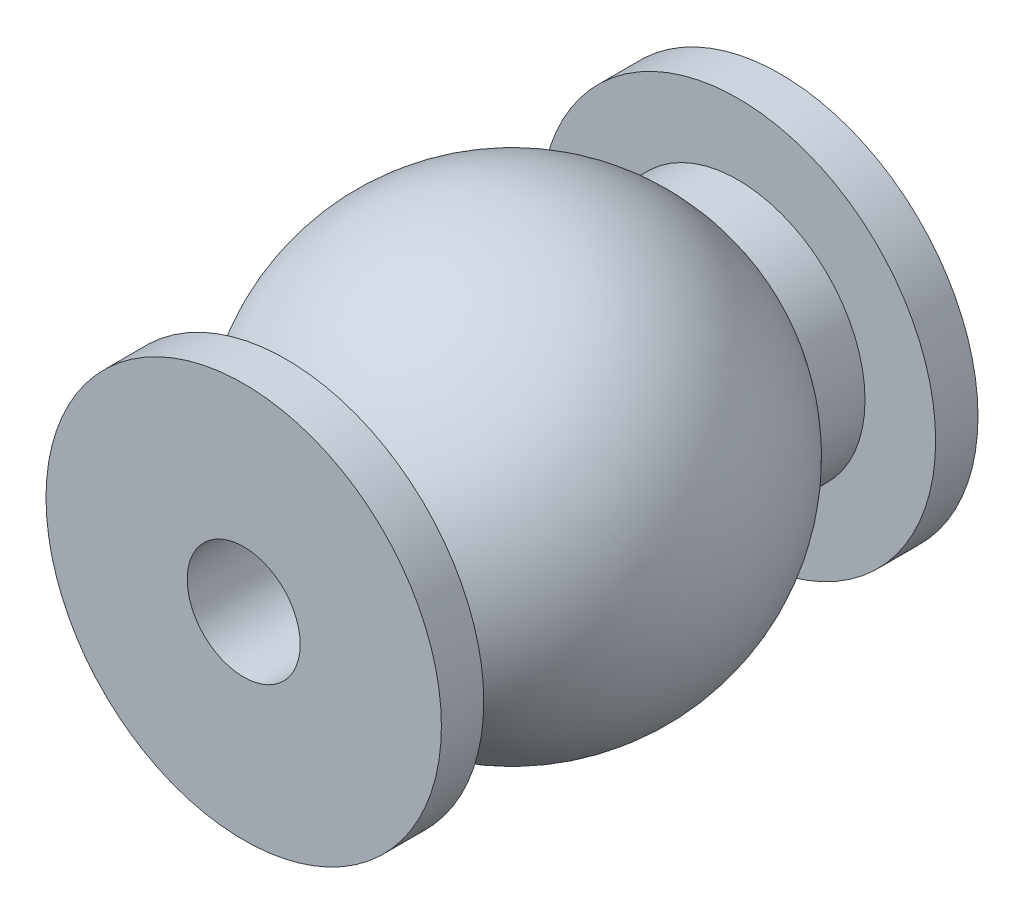
ISO-10303-21;
HEADER;
FILE_DESCRIPTION(('STEP AP214'),'2;1');
FILE_NAME('part.step','',(''),(''),'','','');
FILE_SCHEMA(('AUTOMOTIVE_DESIGN { 1 0 10303 214 1 1 1 1 }'));
ENDSEC;
DATA;
#1=APPLICATION_CONTEXT('core data for automotive mechanical design processes');
#2=APPLICATION_PROTOCOL_DEFINITION('international standard','automotive_design',2000,#1);
#3=PRODUCT_CONTEXT('',#1,'mechanical');
#4=PRODUCT('Part','Part','',(#3));
#5=PRODUCT_RELATED_PRODUCT_CATEGORY('part','',(#4));
#6=PRODUCT_DEFINITION_FORMATION('','',#4);
#7=PRODUCT_DEFINITION_CONTEXT('part definition',#1,'design');
#8=PRODUCT_DEFINITION('design','',#6,#7);
#9=PRODUCT_DEFINITION_SHAPE('','',#8);
#10=(LENGTH_UNIT() NAMED_UNIT(*) SI_UNIT(.MILLI.,.METRE.));
#11=(NAMED_UNIT(*) PLANE_ANGLE_UNIT() SI_UNIT($,.RADIAN.));
#12=(NAMED_UNIT(*) SI_UNIT($,.STERADIAN.) SOLID_ANGLE_UNIT());
#13=UNCERTAINTY_MEASURE_WITH_UNIT(LENGTH_MEASURE(1.E-05),#10,'distance_accuracy_value','');
#14=(GEOMETRIC_REPRESENTATION_CONTEXT(3) GLOBAL_UNCERTAINTY_ASSIGNED_CONTEXT((#13)) GLOBAL_UNIT_ASSIGNED_CONTEXT((#10,
#11,#12)) REPRESENTATION_CONTEXT('',''));
#15=CARTESIAN_POINT('',(0.,0.,0.));
#16=DIRECTION('',(0.,0.,1.));
#17=DIRECTION('',(1.,0.,0.));
#18=AXIS2_PLACEMENT_3D('',#15,#16,#17);
#19=CARTESIAN_POINT('',(-7.00000000000001,0.,-8.00000000000002));
#20=DIRECTION('',(0.,0.,-1.));
#21=DIRECTION('',(-1.,0.,0.));
#22=AXIS2_PLACEMENT_3D('',#19,#20,#21);
#23=PLANE('',#22);
#24=CARTESIAN_POINT('',(0.,0.,-8.00000000000001));
#25=DIRECTION('',(0.,0.,1.));
#26=DIRECTION('',(1.,0.,0.));
#27=AXIS2_PLACEMENT_3D('',#24,#25,#26);
#28=CIRCLE('',#27,4.5);
#29=CARTESIAN_POINT('',(4.5,0.,-8.00000000000001));
#30=VERTEX_POINT('',#29);
#31=EDGE_CURVE('E12',#30,#30,#28,.T.);
#32=ORIENTED_EDGE('',*,*,#31,.F.);
#33=EDGE_LOOP('',(#32));
#34=FACE_BOUND('',#33,.T.);
#35=CARTESIAN_POINT('',(0.,0.,-8.00000000000001));
#36=DIRECTION('',(0.,0.,1.));
#37=DIRECTION('',(1.,0.,0.));
#38=AXIS2_PLACEMENT_3D('',#35,#36,#37);
#39=CIRCLE('',#38,7.);
#40=CARTESIAN_POINT('',(7.,0.,-8.00000000000001));
#41=VERTEX_POINT('',#40);
#42=EDGE_CURVE('E76',#41,#41,#39,.T.);
#43=ORIENTED_EDGE('',*,*,#42,.T.);
#44=EDGE_LOOP('',(#43));
#45=FACE_BOUND('',#44,.T.);
#46=ADVANCED_FACE('F48',(#34,#45),#23,.F.);
#47=CARTESIAN_POINT('',(0.,0.,9.50000000000001));
#48=DIRECTION('',(0.,0.,1.));
#49=DIRECTION('',(1.,0.,0.));
#50=AXIS2_PLACEMENT_3D('',#47,#48,#49);
#51=CYLINDRICAL_SURFACE('',#50,4.5);
#52=CARTESIAN_POINT('',(0.,0.,-6.30971473206199));
#53=DIRECTION('',(0.,0.,1.));
#54=DIRECTION('',(1.,0.,0.));
#55=AXIS2_PLACEMENT_3D('',#52,#53,#54);
#56=CIRCLE('',#55,4.5);
#57=CARTESIAN_POINT('',(4.5,0.,-6.30971473206199));
#58=VERTEX_POINT('',#57);
#59=EDGE_CURVE('E54',#58,#58,#56,.T.);
#60=ORIENTED_EDGE('',*,*,#59,.F.);
#61=EDGE_LOOP('',(#60));
#62=FACE_BOUND('',#61,.T.);
#63=ORIENTED_EDGE('',*,*,#31,.T.);
#64=EDGE_LOOP('',(#63));
#65=FACE_BOUND('',#64,.T.);
#66=ADVANCED_FACE('F115',(#62,#65),#51,.T.);
#67=CARTESIAN_POINT('',(0.,0.,0.));
#68=DIRECTION('',(0.,0.,1.));
#69=DIRECTION('',(-1.,0.,0.));
#70=AXIS2_PLACEMENT_3D('',#67,#68,#69);
#71=SPHERICAL_SURFACE('',#70,7.75);
#72=CARTESIAN_POINT('',(0.,0.,6.30971473206199));
#73=DIRECTION('',(0.,0.,1.));
#74=DIRECTION('',(1.,0.,0.));
#75=AXIS2_PLACEMENT_3D('',#72,#73,#74);
#76=CIRCLE('',#75,4.49999999999999);
#77=CARTESIAN_POINT('',(4.5,0.,6.30971473206199));
#78=VERTEX_POINT('',#77);
#79=EDGE_CURVE('E58',#78,#78,#76,.T.);
#80=ORIENTED_EDGE('',*,*,#79,.F.);
#81=EDGE_LOOP('',(#80));
#82=FACE_BOUND('',#81,.T.);
#83=ORIENTED_EDGE('',*,*,#59,.T.);
#84=EDGE_LOOP('',(#83));
#85=FACE_BOUND('',#84,.T.);
#86=ADVANCED_FACE('F110',(#82,#85),#71,.T.);
#87=CARTESIAN_POINT('',(0.,0.,9.50000000000001));
#88=DIRECTION('',(0.,0.,1.));
#89=DIRECTION('',(1.,0.,0.));
#90=AXIS2_PLACEMENT_3D('',#87,#88,#89);
#91=CYLINDRICAL_SURFACE('',#90,4.49999999999999);
#92=CARTESIAN_POINT('',(0.,0.,8.00000000000001));
#93=DIRECTION('',(0.,0.,1.));
#94=DIRECTION('',(1.,0.,0.));
#95=AXIS2_PLACEMENT_3D('',#92,#93,#94);
#96=CIRCLE('',#95,4.49999999999999);
#97=CARTESIAN_POINT('',(4.5,0.,8.00000000000001));
#98=VERTEX_POINT('',#97);
#99=EDGE_CURVE('E62',#98,#98,#96,.T.);
#100=ORIENTED_EDGE('',*,*,#99,.F.);
#101=EDGE_LOOP('',(#100));
#102=FACE_BOUND('',#101,.T.);
#103=ORIENTED_EDGE('',*,*,#79,.T.);
#104=EDGE_LOOP('',(#103));
#105=FACE_BOUND('',#104,.T.);
#106=ADVANCED_FACE('F104',(#102,#105),#91,.T.);
#107=CARTESIAN_POINT('',(-7.00000000000001,0.,7.99999999999999));
#108=DIRECTION('',(0.,0.,1.));
#109=DIRECTION('',(1.,0.,0.));
#110=AXIS2_PLACEMENT_3D('',#107,#108,#109);
#111=PLANE('',#110);
#112=CARTESIAN_POINT('',(0.,0.,8.00000000000001));
#113=DIRECTION('',(0.,0.,1.));
#114=DIRECTION('',(1.,0.,0.));
#115=AXIS2_PLACEMENT_3D('',#112,#113,#114);
#116=CIRCLE('',#115,7.);
#117=CARTESIAN_POINT('',(7.,0.,8.00000000000001));
#118=VERTEX_POINT('',#117);
#119=EDGE_CURVE('E67',#118,#118,#116,.T.);
#120=ORIENTED_EDGE('',*,*,#119,.F.);
#121=EDGE_LOOP('',(#120));
#122=FACE_BOUND('',#121,.T.);
#123=ORIENTED_EDGE('',*,*,#99,.T.);
#124=EDGE_LOOP('',(#123));
#125=FACE_BOUND('',#124,.T.);
#126=ADVANCED_FACE('F98',(#122,#125),#111,.F.);
#127=CARTESIAN_POINT('',(0.,0.,9.50000000000001));
#128=DIRECTION('',(0.,0.,1.));
#129=DIRECTION('',(1.,0.,0.));
#130=AXIS2_PLACEMENT_3D('',#127,#128,#129);
#131=CYLINDRICAL_SURFACE('',#130,7.);
#132=CARTESIAN_POINT('',(0.,0.,9.50000000000001));
#133=DIRECTION('',(0.,0.,1.));
#134=DIRECTION('',(1.,0.,0.));
#135=AXIS2_PLACEMENT_3D('',#132,#133,#134);
#136=CIRCLE('',#135,7.);
#137=CARTESIAN_POINT('',(7.,0.,9.50000000000001));
#138=VERTEX_POINT('',#137);
#139=EDGE_CURVE('E70',#138,#138,#136,.T.);
#140=ORIENTED_EDGE('',*,*,#139,.F.);
#141=EDGE_LOOP('',(#140));
#142=FACE_BOUND('',#141,.T.);
#143=ORIENTED_EDGE('',*,*,#119,.T.);
#144=EDGE_LOOP('',(#143));
#145=FACE_BOUND('',#144,.T.);
#146=ADVANCED_FACE('F92',(#142,#145),#131,.T.);
#147=CARTESIAN_POINT('',(-7.00000000000001,0.,9.49999999999999));
#148=DIRECTION('',(0.,0.,-1.));
#149=DIRECTION('',(-1.,0.,0.));
#150=AXIS2_PLACEMENT_3D('',#147,#148,#149);
#151=PLANE('',#150);
#152=CARTESIAN_POINT('',(0.,0.,9.50000000000001));
#153=DIRECTION('',(0.,0.,1.));
#154=DIRECTION('',(1.,0.,0.));
#155=AXIS2_PLACEMENT_3D('',#152,#153,#154);
#156=CIRCLE('',#155,2.);
#157=CARTESIAN_POINT('',(2.,0.,9.50000000000001));
#158=VERTEX_POINT('',#157);
#159=EDGE_CURVE('E82',#158,#158,#156,.T.);
#160=ORIENTED_EDGE('',*,*,#159,.F.);
#161=EDGE_LOOP('',(#160));
#162=FACE_BOUND('',#161,.T.);
#163=ORIENTED_EDGE('',*,*,#139,.T.);
#164=EDGE_LOOP('',(#163));
#165=FACE_BOUND('',#164,.T.);
#166=ADVANCED_FACE('F88',(#162,#165),#151,.F.);
#167=CARTESIAN_POINT('',(-7.00000000000001,0.,-9.50000000000001));
#168=DIRECTION('',(0.,0.,1.));
#169=DIRECTION('',(1.,0.,0.));
#170=AXIS2_PLACEMENT_3D('',#167,#168,#169);
#171=PLANE('',#170);
#172=CARTESIAN_POINT('',(0.,0.,-9.50000000000001));
#173=DIRECTION('',(0.,0.,1.));
#174=DIRECTION('',(1.,0.,0.));
#175=AXIS2_PLACEMENT_3D('',#172,#173,#174);
#176=CIRCLE('',#175,2.);
#177=CARTESIAN_POINT('',(2.,0.,-9.50000000000001));
#178=VERTEX_POINT('',#177);
#179=EDGE_CURVE('E79',#178,#178,#176,.T.);
#180=ORIENTED_EDGE('',*,*,#179,.T.);
#181=EDGE_LOOP('',(#180));
#182=FACE_BOUND('',#181,.T.);
#183=CARTESIAN_POINT('',(0.,0.,-9.50000000000001));
#184=DIRECTION('',(0.,0.,1.));
#185=DIRECTION('',(1.,0.,0.));
#186=AXIS2_PLACEMENT_3D('',#183,#184,#185);
#187=CIRCLE('',#186,7.);
#188=CARTESIAN_POINT('',(7.,0.,-9.50000000000001));
#189=VERTEX_POINT('',#188);
#190=EDGE_CURVE('E73',#189,#189,#187,.T.);
#191=ORIENTED_EDGE('',*,*,#190,.F.);
#192=EDGE_LOOP('',(#191));
#193=FACE_BOUND('',#192,.T.);
#194=ADVANCED_FACE('F91',(#182,#193),#171,.F.);
#195=CARTESIAN_POINT('',(0.,0.,9.50000000000001));
#196=DIRECTION('',(0.,0.,1.));
#197=DIRECTION('',(1.,0.,0.));
#198=AXIS2_PLACEMENT_3D('',#195,#196,#197);
#199=CYLINDRICAL_SURFACE('',#198,7.);
#200=ORIENTED_EDGE('',*,*,#42,.F.);
#201=EDGE_LOOP('',(#200));
#202=FACE_BOUND('',#201,.T.);
#203=ORIENTED_EDGE('',*,*,#190,.T.);
#204=EDGE_LOOP('',(#203));
#205=FACE_BOUND('',#204,.T.);
#206=ADVANCED_FACE('F128',(#202,#205),#199,.T.);
#207=CARTESIAN_POINT('',(0.,0.,9.50000000000001));
#208=DIRECTION('',(0.,0.,1.));
#209=DIRECTION('',(1.,0.,0.));
#210=AXIS2_PLACEMENT_3D('',#207,#208,#209);
#211=CYLINDRICAL_SURFACE('',#210,2.);
#212=ORIENTED_EDGE('',*,*,#179,.F.);
#213=EDGE_LOOP('',(#212));
#214=FACE_BOUND('',#213,.T.);
#215=ORIENTED_EDGE('',*,*,#159,.T.);
#216=EDGE_LOOP('',(#215));
#217=FACE_BOUND('',#216,.T.);
#218=ADVANCED_FACE('F86',(#214,#217),#211,.F.);
#219=CLOSED_SHELL('',(#46,#66,#86,#106,#126,#146,#166,#194,#206,#218));
#220=MANIFOLD_SOLID_BREP('B2',#219);
#221=ADVANCED_BREP_SHAPE_REPRESENTATION('',(#18,#220),#14);
#222=SHAPE_DEFINITION_REPRESENTATION(#9,#221);
ENDSEC;
END-ISO-10303-21;
